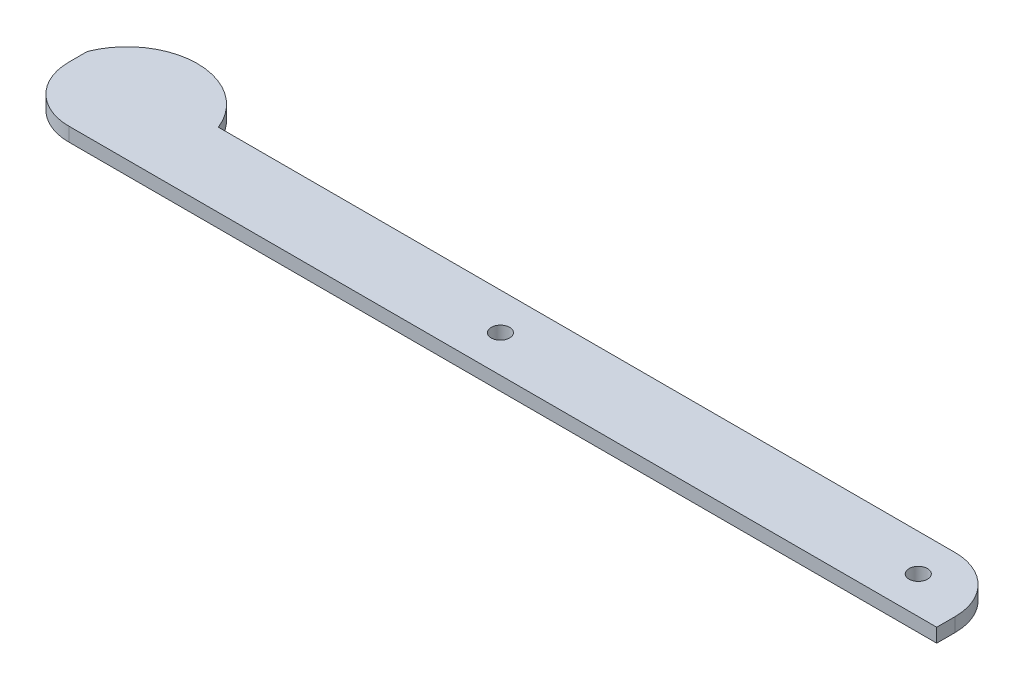
ISO-10303-21;
HEADER;
FILE_DESCRIPTION(('STEP AP214'),'2;1');
FILE_NAME('part.step','',(''),(''),'','','');
FILE_SCHEMA(('AUTOMOTIVE_DESIGN { 1 0 10303 214 1 1 1 1 }'));
ENDSEC;
DATA;
#1=APPLICATION_CONTEXT('core data for automotive mechanical design processes');
#2=APPLICATION_PROTOCOL_DEFINITION('international standard','automotive_design',2000,#1);
#3=PRODUCT_CONTEXT('',#1,'mechanical');
#4=PRODUCT('Part','Part','',(#3));
#5=PRODUCT_RELATED_PRODUCT_CATEGORY('part','',(#4));
#6=PRODUCT_DEFINITION_FORMATION('','',#4);
#7=PRODUCT_DEFINITION_CONTEXT('part definition',#1,'design');
#8=PRODUCT_DEFINITION('design','',#6,#7);
#9=PRODUCT_DEFINITION_SHAPE('','',#8);
#10=(LENGTH_UNIT() NAMED_UNIT(*) SI_UNIT(.MILLI.,.METRE.));
#11=(NAMED_UNIT(*) PLANE_ANGLE_UNIT() SI_UNIT($,.RADIAN.));
#12=(NAMED_UNIT(*) SI_UNIT($,.STERADIAN.) SOLID_ANGLE_UNIT());
#13=UNCERTAINTY_MEASURE_WITH_UNIT(LENGTH_MEASURE(1.E-05),#10,'distance_accuracy_value','');
#14=(GEOMETRIC_REPRESENTATION_CONTEXT(3) GLOBAL_UNCERTAINTY_ASSIGNED_CONTEXT((#13)) GLOBAL_UNIT_ASSIGNED_CONTEXT((#10,
#11,#12)) REPRESENTATION_CONTEXT('',''));
#15=CARTESIAN_POINT('',(0.,0.,0.));
#16=DIRECTION('',(0.,0.,1.));
#17=DIRECTION('',(1.,0.,0.));
#18=AXIS2_PLACEMENT_3D('',#15,#16,#17);
#19=CARTESIAN_POINT('',(-544.828278679985,19.05,-15.1678958030318));
#20=DIRECTION('',(0.,-1.,0.));
#21=DIRECTION('',(0.,0.,-1.));
#22=AXIS2_PLACEMENT_3D('',#19,#20,#21);
#23=PLANE('',#22);
#24=CARTESIAN_POINT('',(-15.9399999999998,19.05,0.));
#25=DIRECTION('',(0.,1.,0.));
#26=DIRECTION('',(0.,0.,1.));
#27=AXIS2_PLACEMENT_3D('',#24,#25,#26);
#28=CIRCLE('',#27,12.7);
#29=CARTESIAN_POINT('',(-15.9399999999998,19.05,12.7));
#30=VERTEX_POINT('',#29);
#31=EDGE_CURVE('E130',#30,#30,#28,.T.);
#32=ORIENTED_EDGE('',*,*,#31,.F.);
#33=EDGE_LOOP('',(#32));
#34=FACE_BOUND('',#33,.T.);
#35=CARTESIAN_POINT('',(-544.828278679985,19.05,-15.1678958030318));
#36=DIRECTION('',(0.,1.,0.));
#37=DIRECTION('',(0.,0.,-1.));
#38=AXIS2_PLACEMENT_3D('',#35,#36,#37);
#39=CIRCLE('',#38,96.9566200695861);
#40=CARTESIAN_POINT('',(-454.656557359969,19.05,-50.8));
#41=VERTEX_POINT('',#40);
#42=CARTESIAN_POINT('',(-635.,19.05,-50.8));
#43=VERTEX_POINT('',#42);
#44=EDGE_CURVE('E139',#41,#43,#39,.T.);
#45=ORIENTED_EDGE('',*,*,#44,.T.);
#46=DIRECTION('',(0.,0.,1.));
#47=VECTOR('',#46,1.);
#48=CARTESIAN_POINT('',(-635.,19.05,-25.4));
#49=LINE('',#48,#47);
#50=CARTESIAN_POINT('',(-635.,19.05,-25.4));
#51=VERTEX_POINT('',#50);
#52=EDGE_CURVE('E92',#43,#51,#49,.T.);
#53=ORIENTED_EDGE('',*,*,#52,.T.);
#54=CARTESIAN_POINT('',(-558.8,19.05,-25.4));
#55=DIRECTION('',(0.,1.,0.));
#56=DIRECTION('',(0.,0.,-1.));
#57=AXIS2_PLACEMENT_3D('',#54,#55,#56);
#58=CIRCLE('',#57,76.2);
#59=CARTESIAN_POINT('',(-558.8,19.05,50.8));
#60=VERTEX_POINT('',#59);
#61=EDGE_CURVE('E151',#51,#60,#58,.T.);
#62=ORIENTED_EDGE('',*,*,#61,.T.);
#63=DIRECTION('',(1.,0.,0.));
#64=VECTOR('',#63,1.);
#65=CARTESIAN_POINT('',(-558.8,19.05,50.8));
#66=LINE('',#65,#64);
#67=CARTESIAN_POINT('',(635.,19.05,50.8));
#68=VERTEX_POINT('',#67);
#69=EDGE_CURVE('E108',#60,#68,#66,.T.);
#70=ORIENTED_EDGE('',*,*,#69,.T.);
#71=DIRECTION('',(0.,0.,-1.));
#72=VECTOR('',#71,1.);
#73=CARTESIAN_POINT('',(635.,19.05,50.8));
#74=LINE('',#73,#72);
#75=CARTESIAN_POINT('',(635.,19.05,25.4));
#76=VERTEX_POINT('',#75);
#77=EDGE_CURVE('E102',#68,#76,#74,.T.);
#78=ORIENTED_EDGE('',*,*,#77,.T.);
#79=CARTESIAN_POINT('',(558.8,19.05,25.4));
#80=DIRECTION('',(0.,1.,0.));
#81=DIRECTION('',(0.,0.,-1.));
#82=AXIS2_PLACEMENT_3D('',#79,#80,#81);
#83=CIRCLE('',#82,76.2);
#84=CARTESIAN_POINT('',(558.8,19.05,-50.8));
#85=VERTEX_POINT('',#84);
#86=EDGE_CURVE('E106',#76,#85,#83,.T.);
#87=ORIENTED_EDGE('',*,*,#86,.T.);
#88=DIRECTION('',(-1.,0.,0.));
#89=VECTOR('',#88,1.);
#90=CARTESIAN_POINT('',(-454.656557359969,19.05,-50.8));
#91=LINE('',#90,#89);
#92=EDGE_CURVE('E52',#85,#41,#91,.T.);
#93=ORIENTED_EDGE('',*,*,#92,.T.);
#94=EDGE_LOOP('',(#45,#53,#62,#70,#78,#87,#93));
#95=FACE_BOUND('',#94,.T.);
#96=CARTESIAN_POINT('',(558.8,19.05,0.));
#97=DIRECTION('',(0.,1.,0.));
#98=DIRECTION('',(0.,0.,1.));
#99=AXIS2_PLACEMENT_3D('',#96,#97,#98);
#100=CIRCLE('',#99,12.7);
#101=CARTESIAN_POINT('',(558.8,19.05,12.7));
#102=VERTEX_POINT('',#101);
#103=EDGE_CURVE('E166',#102,#102,#100,.T.);
#104=ORIENTED_EDGE('',*,*,#103,.F.);
#105=EDGE_LOOP('',(#104));
#106=FACE_BOUND('',#105,.T.);
#107=ADVANCED_FACE('F35',(#34,#95,#106),#23,.F.);
#108=CARTESIAN_POINT('',(-544.828278679985,0.,-15.1678958030318));
#109=DIRECTION('',(0.,-1.,0.));
#110=DIRECTION('',(0.,0.,-1.));
#111=AXIS2_PLACEMENT_3D('',#108,#109,#110);
#112=PLANE('',#111);
#113=CARTESIAN_POINT('',(-15.9399999999998,0.,0.));
#114=DIRECTION('',(0.,1.,0.));
#115=DIRECTION('',(0.,0.,1.));
#116=AXIS2_PLACEMENT_3D('',#113,#114,#115);
#117=CIRCLE('',#116,12.7);
#118=CARTESIAN_POINT('',(-15.9399999999998,0.,12.7));
#119=VERTEX_POINT('',#118);
#120=EDGE_CURVE('E163',#119,#119,#117,.T.);
#121=ORIENTED_EDGE('',*,*,#120,.T.);
#122=EDGE_LOOP('',(#121));
#123=FACE_BOUND('',#122,.T.);
#124=CARTESIAN_POINT('',(-544.828278679985,0.,-15.1678958030318));
#125=DIRECTION('',(0.,1.,0.));
#126=DIRECTION('',(0.,0.,-1.));
#127=AXIS2_PLACEMENT_3D('',#124,#125,#126);
#128=CIRCLE('',#127,96.9566200695861);
#129=CARTESIAN_POINT('',(-454.656557359969,0.,-50.8));
#130=VERTEX_POINT('',#129);
#131=CARTESIAN_POINT('',(-635.,0.,-50.8));
#132=VERTEX_POINT('',#131);
#133=EDGE_CURVE('E126',#130,#132,#128,.T.);
#134=ORIENTED_EDGE('',*,*,#133,.F.);
#135=DIRECTION('',(-1.,0.,0.));
#136=VECTOR('',#135,1.);
#137=CARTESIAN_POINT('',(-454.656557359969,0.,-50.8));
#138=LINE('',#137,#136);
#139=CARTESIAN_POINT('',(558.8,0.,-50.8));
#140=VERTEX_POINT('',#139);
#141=EDGE_CURVE('E84',#140,#130,#138,.T.);
#142=ORIENTED_EDGE('',*,*,#141,.F.);
#143=CARTESIAN_POINT('',(558.8,0.,25.4));
#144=DIRECTION('',(0.,1.,0.));
#145=DIRECTION('',(0.,0.,-1.));
#146=AXIS2_PLACEMENT_3D('',#143,#144,#145);
#147=CIRCLE('',#146,76.2);
#148=CARTESIAN_POINT('',(635.,0.,25.4));
#149=VERTEX_POINT('',#148);
#150=EDGE_CURVE('E78',#149,#140,#147,.T.);
#151=ORIENTED_EDGE('',*,*,#150,.F.);
#152=DIRECTION('',(0.,0.,-1.));
#153=VECTOR('',#152,1.);
#154=CARTESIAN_POINT('',(635.,0.,50.8));
#155=LINE('',#154,#153);
#156=CARTESIAN_POINT('',(635.,0.,50.8));
#157=VERTEX_POINT('',#156);
#158=EDGE_CURVE('E116',#157,#149,#155,.T.);
#159=ORIENTED_EDGE('',*,*,#158,.F.);
#160=DIRECTION('',(1.,0.,0.));
#161=VECTOR('',#160,1.);
#162=CARTESIAN_POINT('',(-558.8,0.,50.8));
#163=LINE('',#162,#161);
#164=CARTESIAN_POINT('',(-558.8,0.,50.8));
#165=VERTEX_POINT('',#164);
#166=EDGE_CURVE('E134',#165,#157,#163,.T.);
#167=ORIENTED_EDGE('',*,*,#166,.F.);
#168=CARTESIAN_POINT('',(-558.8,0.,-25.4));
#169=DIRECTION('',(0.,1.,0.));
#170=DIRECTION('',(0.,0.,-1.));
#171=AXIS2_PLACEMENT_3D('',#168,#169,#170);
#172=CIRCLE('',#171,76.2);
#173=CARTESIAN_POINT('',(-635.,0.,-25.4));
#174=VERTEX_POINT('',#173);
#175=EDGE_CURVE('E132',#174,#165,#172,.T.);
#176=ORIENTED_EDGE('',*,*,#175,.F.);
#177=DIRECTION('',(0.,0.,1.));
#178=VECTOR('',#177,1.);
#179=CARTESIAN_POINT('',(-635.,0.,-25.4));
#180=LINE('',#179,#178);
#181=EDGE_CURVE('E129',#132,#174,#180,.T.);
#182=ORIENTED_EDGE('',*,*,#181,.F.);
#183=EDGE_LOOP('',(#134,#142,#151,#159,#167,#176,#182));
#184=FACE_BOUND('',#183,.T.);
#185=CARTESIAN_POINT('',(558.8,0.,0.));
#186=DIRECTION('',(0.,1.,0.));
#187=DIRECTION('',(0.,0.,1.));
#188=AXIS2_PLACEMENT_3D('',#185,#186,#187);
#189=CIRCLE('',#188,12.7);
#190=CARTESIAN_POINT('',(558.8,0.,12.7));
#191=VERTEX_POINT('',#190);
#192=EDGE_CURVE('E169',#191,#191,#189,.T.);
#193=ORIENTED_EDGE('',*,*,#192,.T.);
#194=EDGE_LOOP('',(#193));
#195=FACE_BOUND('',#194,.T.);
#196=ADVANCED_FACE('F155',(#123,#184,#195),#112,.T.);
#197=CARTESIAN_POINT('',(-544.828278679985,19.05,-15.1678958030318));
#198=DIRECTION('',(0.,-1.,0.));
#199=DIRECTION('',(0.,0.,-1.));
#200=AXIS2_PLACEMENT_3D('',#197,#198,#199);
#201=CYLINDRICAL_SURFACE('',#200,96.9566200695861);
#202=ORIENTED_EDGE('',*,*,#133,.T.);
#203=DIRECTION('',(0.,-1.,0.));
#204=VECTOR('',#203,1.);
#205=CARTESIAN_POINT('',(-635.,19.05,-50.8));
#206=LINE('',#205,#204);
#207=EDGE_CURVE('E11',#43,#132,#206,.T.);
#208=ORIENTED_EDGE('',*,*,#207,.F.);
#209=ORIENTED_EDGE('',*,*,#44,.F.);
#210=DIRECTION('',(0.,-1.,0.));
#211=VECTOR('',#210,1.);
#212=CARTESIAN_POINT('',(-454.656557359969,19.05,-50.8));
#213=LINE('',#212,#211);
#214=EDGE_CURVE('E122',#41,#130,#213,.T.);
#215=ORIENTED_EDGE('',*,*,#214,.T.);
#216=EDGE_LOOP('',(#202,#208,#209,#215));
#217=FACE_BOUND('',#216,.T.);
#218=ADVANCED_FACE('F37',(#217),#201,.T.);
#219=CARTESIAN_POINT('',(-635.,19.05,-25.4));
#220=DIRECTION('',(1.,0.,0.));
#221=DIRECTION('',(0.,0.,-1.));
#222=AXIS2_PLACEMENT_3D('',#219,#220,#221);
#223=PLANE('',#222);
#224=ORIENTED_EDGE('',*,*,#181,.T.);
#225=DIRECTION('',(0.,-1.,0.));
#226=VECTOR('',#225,1.);
#227=CARTESIAN_POINT('',(-635.,19.05,-25.4));
#228=LINE('',#227,#226);
#229=EDGE_CURVE('E44',#51,#174,#228,.T.);
#230=ORIENTED_EDGE('',*,*,#229,.F.);
#231=ORIENTED_EDGE('',*,*,#52,.F.);
#232=ORIENTED_EDGE('',*,*,#207,.T.);
#233=EDGE_LOOP('',(#224,#230,#231,#232));
#234=FACE_BOUND('',#233,.T.);
#235=ADVANCED_FACE('F200',(#234),#223,.F.);
#236=CARTESIAN_POINT('',(-558.8,19.05,-25.4));
#237=DIRECTION('',(0.,-1.,0.));
#238=DIRECTION('',(0.,0.,-1.));
#239=AXIS2_PLACEMENT_3D('',#236,#237,#238);
#240=CYLINDRICAL_SURFACE('',#239,76.2);
#241=ORIENTED_EDGE('',*,*,#175,.T.);
#242=DIRECTION('',(0.,-1.,0.));
#243=VECTOR('',#242,1.);
#244=CARTESIAN_POINT('',(-558.8,19.05,50.8));
#245=LINE('',#244,#243);
#246=EDGE_CURVE('E143',#60,#165,#245,.T.);
#247=ORIENTED_EDGE('',*,*,#246,.F.);
#248=ORIENTED_EDGE('',*,*,#61,.F.);
#249=ORIENTED_EDGE('',*,*,#229,.T.);
#250=EDGE_LOOP('',(#241,#247,#248,#249));
#251=FACE_BOUND('',#250,.T.);
#252=ADVANCED_FACE('F149',(#251),#240,.T.);
#253=CARTESIAN_POINT('',(-558.8,19.05,50.8));
#254=DIRECTION('',(0.,0.,-1.));
#255=DIRECTION('',(-1.,0.,0.));
#256=AXIS2_PLACEMENT_3D('',#253,#254,#255);
#257=PLANE('',#256);
#258=ORIENTED_EDGE('',*,*,#166,.T.);
#259=DIRECTION('',(0.,-1.,0.));
#260=VECTOR('',#259,1.);
#261=CARTESIAN_POINT('',(635.,19.05,50.8));
#262=LINE('',#261,#260);
#263=EDGE_CURVE('E117',#68,#157,#262,.T.);
#264=ORIENTED_EDGE('',*,*,#263,.F.);
#265=ORIENTED_EDGE('',*,*,#69,.F.);
#266=ORIENTED_EDGE('',*,*,#246,.T.);
#267=EDGE_LOOP('',(#258,#264,#265,#266));
#268=FACE_BOUND('',#267,.T.);
#269=ADVANCED_FACE('F158',(#268),#257,.F.);
#270=CARTESIAN_POINT('',(635.,19.05,50.8));
#271=DIRECTION('',(-1.,0.,0.));
#272=DIRECTION('',(0.,0.,1.));
#273=AXIS2_PLACEMENT_3D('',#270,#271,#272);
#274=PLANE('',#273);
#275=ORIENTED_EDGE('',*,*,#158,.T.);
#276=DIRECTION('',(0.,-1.,0.));
#277=VECTOR('',#276,1.);
#278=CARTESIAN_POINT('',(635.,19.05,25.4));
#279=LINE('',#278,#277);
#280=EDGE_CURVE('E113',#76,#149,#279,.T.);
#281=ORIENTED_EDGE('',*,*,#280,.F.);
#282=ORIENTED_EDGE('',*,*,#77,.F.);
#283=ORIENTED_EDGE('',*,*,#263,.T.);
#284=EDGE_LOOP('',(#275,#281,#282,#283));
#285=FACE_BOUND('',#284,.T.);
#286=ADVANCED_FACE('F114',(#285),#274,.F.);
#287=CARTESIAN_POINT('',(558.8,19.05,25.4));
#288=DIRECTION('',(0.,-1.,0.));
#289=DIRECTION('',(0.,0.,-1.));
#290=AXIS2_PLACEMENT_3D('',#287,#288,#289);
#291=CYLINDRICAL_SURFACE('',#290,76.2);
#292=ORIENTED_EDGE('',*,*,#150,.T.);
#293=DIRECTION('',(0.,-1.,0.));
#294=VECTOR('',#293,1.);
#295=CARTESIAN_POINT('',(558.8,19.05,-50.8));
#296=LINE('',#295,#294);
#297=EDGE_CURVE('E118',#85,#140,#296,.T.);
#298=ORIENTED_EDGE('',*,*,#297,.F.);
#299=ORIENTED_EDGE('',*,*,#86,.F.);
#300=ORIENTED_EDGE('',*,*,#280,.T.);
#301=EDGE_LOOP('',(#292,#298,#299,#300));
#302=FACE_BOUND('',#301,.T.);
#303=ADVANCED_FACE('F120',(#302),#291,.T.);
#304=CARTESIAN_POINT('',(-454.656557359969,19.05,-50.8));
#305=DIRECTION('',(0.,0.,1.));
#306=DIRECTION('',(1.,0.,0.));
#307=AXIS2_PLACEMENT_3D('',#304,#305,#306);
#308=PLANE('',#307);
#309=ORIENTED_EDGE('',*,*,#141,.T.);
#310=ORIENTED_EDGE('',*,*,#214,.F.);
#311=ORIENTED_EDGE('',*,*,#92,.F.);
#312=ORIENTED_EDGE('',*,*,#297,.T.);
#313=EDGE_LOOP('',(#309,#310,#311,#312));
#314=FACE_BOUND('',#313,.T.);
#315=ADVANCED_FACE('F190',(#314),#308,.F.);
#316=CARTESIAN_POINT('',(-15.9399999999998,19.05,0.));
#317=DIRECTION('',(0.,-1.,0.));
#318=DIRECTION('',(0.,0.,-1.));
#319=AXIS2_PLACEMENT_3D('',#316,#317,#318);
#320=CYLINDRICAL_SURFACE('',#319,12.7);
#321=ORIENTED_EDGE('',*,*,#31,.T.);
#322=EDGE_LOOP('',(#321));
#323=FACE_BOUND('',#322,.T.);
#324=ORIENTED_EDGE('',*,*,#120,.F.);
#325=EDGE_LOOP('',(#324));
#326=FACE_BOUND('',#325,.T.);
#327=ADVANCED_FACE('F187',(#323,#326),#320,.F.);
#328=CARTESIAN_POINT('',(558.8,19.05,0.));
#329=DIRECTION('',(0.,-1.,0.));
#330=DIRECTION('',(0.,0.,-1.));
#331=AXIS2_PLACEMENT_3D('',#328,#329,#330);
#332=CYLINDRICAL_SURFACE('',#331,12.7);
#333=ORIENTED_EDGE('',*,*,#103,.T.);
#334=EDGE_LOOP('',(#333));
#335=FACE_BOUND('',#334,.T.);
#336=ORIENTED_EDGE('',*,*,#192,.F.);
#337=EDGE_LOOP('',(#336));
#338=FACE_BOUND('',#337,.T.);
#339=ADVANCED_FACE('F175',(#335,#338),#332,.F.);
#340=CLOSED_SHELL('',(#107,#196,#218,#235,#252,#269,#286,#303,#315,#327,#339));
#341=MANIFOLD_SOLID_BREP('B2',#340);
#342=ADVANCED_BREP_SHAPE_REPRESENTATION('',(#18,#341),#14);
#343=SHAPE_DEFINITION_REPRESENTATION(#9,#342);
ENDSEC;
END-ISO-10303-21;
